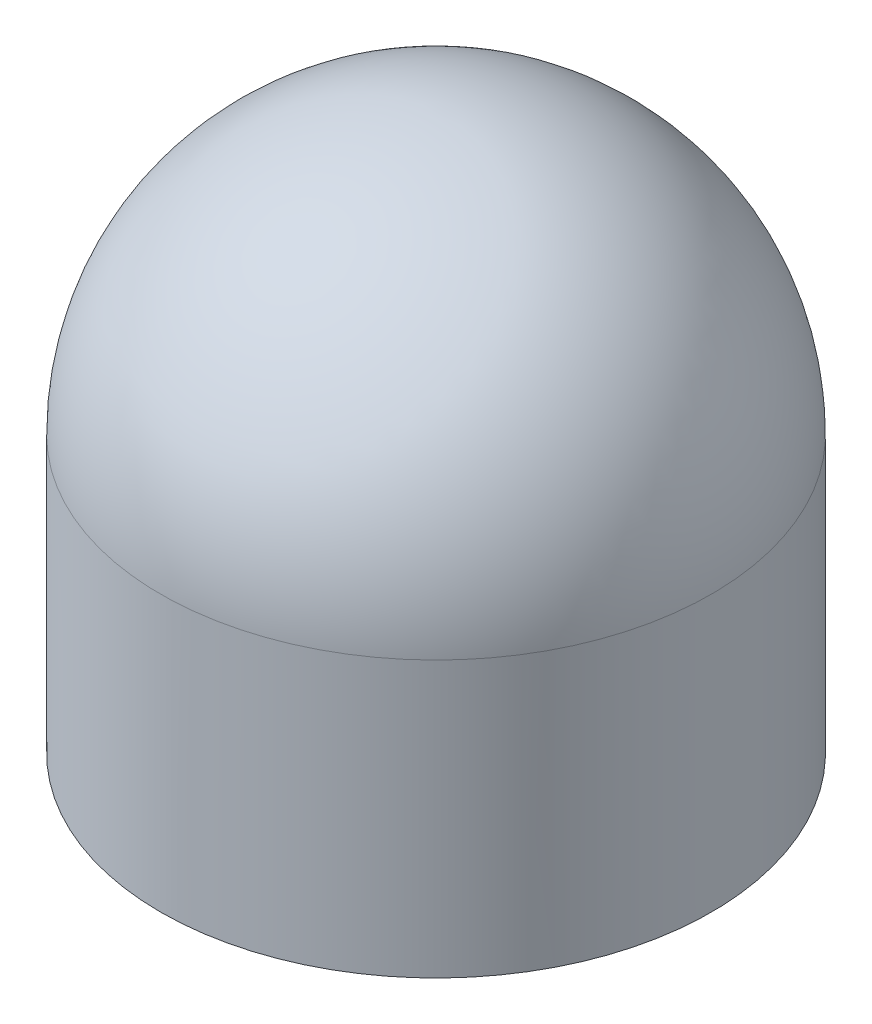
ISO-10303-21;
HEADER;
FILE_DESCRIPTION(('STEP AP214'),'2;1');
FILE_NAME('part.step','',(''),(''),'','','');
FILE_SCHEMA(('AUTOMOTIVE_DESIGN { 1 0 10303 214 1 1 1 1 }'));
ENDSEC;
DATA;
#1=APPLICATION_CONTEXT('core data for automotive mechanical design processes');
#2=APPLICATION_PROTOCOL_DEFINITION('international standard','automotive_design',2000,#1);
#3=PRODUCT_CONTEXT('',#1,'mechanical');
#4=PRODUCT('Part','Part','',(#3));
#5=PRODUCT_RELATED_PRODUCT_CATEGORY('part','',(#4));
#6=PRODUCT_DEFINITION_FORMATION('','',#4);
#7=PRODUCT_DEFINITION_CONTEXT('part definition',#1,'design');
#8=PRODUCT_DEFINITION('design','',#6,#7);
#9=PRODUCT_DEFINITION_SHAPE('','',#8);
#10=(LENGTH_UNIT() NAMED_UNIT(*) SI_UNIT(.MILLI.,.METRE.));
#11=(NAMED_UNIT(*) PLANE_ANGLE_UNIT() SI_UNIT($,.RADIAN.));
#12=(NAMED_UNIT(*) SI_UNIT($,.STERADIAN.) SOLID_ANGLE_UNIT());
#13=UNCERTAINTY_MEASURE_WITH_UNIT(LENGTH_MEASURE(1.E-05),#10,'distance_accuracy_value','');
#14=(GEOMETRIC_REPRESENTATION_CONTEXT(3) GLOBAL_UNCERTAINTY_ASSIGNED_CONTEXT((#13)) GLOBAL_UNIT_ASSIGNED_CONTEXT((#10,
#11,#12)) REPRESENTATION_CONTEXT('',''));
#15=CARTESIAN_POINT('',(0.,0.,0.));
#16=DIRECTION('',(0.,0.,1.));
#17=DIRECTION('',(1.,0.,0.));
#18=AXIS2_PLACEMENT_3D('',#15,#16,#17);
#19=CARTESIAN_POINT('',(0.,5.,0.));
#20=DIRECTION('',(0.,-1.,0.));
#21=DIRECTION('',(0.,0.,-1.));
#22=AXIS2_PLACEMENT_3D('',#19,#20,#21);
#23=CYLINDRICAL_SURFACE('',#22,2.5);
#24=CARTESIAN_POINT('',(0.,2.5,0.));
#25=DIRECTION('',(0.,-1.,0.));
#26=DIRECTION('',(0.,0.,-1.));
#27=AXIS2_PLACEMENT_3D('',#24,#25,#26);
#28=CIRCLE('',#27,2.5);
#29=CARTESIAN_POINT('',(0.,2.5,-2.5));
#30=VERTEX_POINT('',#29);
#31=EDGE_CURVE('E10',#30,#30,#28,.T.);
#32=ORIENTED_EDGE('',*,*,#31,.T.);
#33=EDGE_LOOP('',(#32));
#34=FACE_BOUND('',#33,.T.);
#35=CARTESIAN_POINT('',(0.,0.,0.));
#36=DIRECTION('',(0.,1.,0.));
#37=DIRECTION('',(0.,0.,1.));
#38=AXIS2_PLACEMENT_3D('',#35,#36,#37);
#39=CIRCLE('',#38,2.5);
#40=CARTESIAN_POINT('',(0.,0.,2.5));
#41=VERTEX_POINT('',#40);
#42=EDGE_CURVE('E36',#41,#41,#39,.T.);
#43=ORIENTED_EDGE('',*,*,#42,.T.);
#44=EDGE_LOOP('',(#43));
#45=FACE_BOUND('',#44,.T.);
#46=ADVANCED_FACE('F29',(#34,#45),#23,.T.);
#47=CARTESIAN_POINT('',(0.,0.,0.));
#48=DIRECTION('',(0.,1.,0.));
#49=DIRECTION('',(0.,0.,1.));
#50=AXIS2_PLACEMENT_3D('',#47,#48,#49);
#51=PLANE('',#50);
#52=ORIENTED_EDGE('',*,*,#42,.F.);
#53=EDGE_LOOP('',(#52));
#54=FACE_BOUND('',#53,.T.);
#55=ADVANCED_FACE('F43',(#54),#51,.F.);
#56=CARTESIAN_POINT('',(0.,2.5,0.));
#57=DIRECTION('',(0.,0.,1.));
#58=DIRECTION('',(1.,0.,0.));
#59=AXIS2_PLACEMENT_3D('',#56,#57,#58);
#60=SPHERICAL_SURFACE('',#59,2.5);
#61=CARTESIAN_POINT('',(0.,2.5,0.));
#62=DIRECTION('',(0.,-1.,0.));
#63=DIRECTION('',(0.,0.,-1.));
#64=AXIS2_PLACEMENT_3D('',#61,#62,#63);
#65=SPHERICAL_SURFACE('',#64,2.5);
#66=ORIENTED_EDGE('',*,*,#31,.F.);
#67=EDGE_LOOP('',(#66));
#68=FACE_BOUND('',#67,.T.);
#69=ADVANCED_FACE('F31',(#68),#65,.T.);
#70=CLOSED_SHELL('',(#46,#55,#69));
#71=MANIFOLD_SOLID_BREP('B2',#70);
#72=ADVANCED_BREP_SHAPE_REPRESENTATION('',(#18,#71),#14);
#73=SHAPE_DEFINITION_REPRESENTATION(#9,#72);
ENDSEC;
END-ISO-10303-21;
